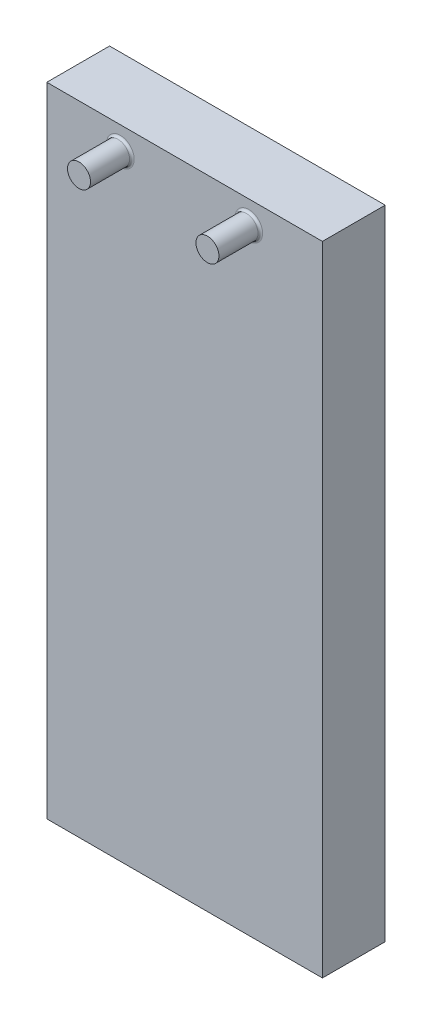
ISO-10303-21;
HEADER;
FILE_DESCRIPTION(('STEP AP214'),'2;1');
FILE_NAME('part.step','',(''),(''),'','','');
FILE_SCHEMA(('AUTOMOTIVE_DESIGN { 1 0 10303 214 1 1 1 1 }'));
ENDSEC;
DATA;
#1=APPLICATION_CONTEXT('core data for automotive mechanical design processes');
#2=APPLICATION_PROTOCOL_DEFINITION('international standard','automotive_design',2000,#1);
#3=PRODUCT_CONTEXT('',#1,'mechanical');
#4=PRODUCT('Part','Part','',(#3));
#5=PRODUCT_RELATED_PRODUCT_CATEGORY('part','',(#4));
#6=PRODUCT_DEFINITION_FORMATION('','',#4);
#7=PRODUCT_DEFINITION_CONTEXT('part definition',#1,'design');
#8=PRODUCT_DEFINITION('design','',#6,#7);
#9=PRODUCT_DEFINITION_SHAPE('','',#8);
#10=(LENGTH_UNIT() NAMED_UNIT(*) SI_UNIT(.MILLI.,.METRE.));
#11=(NAMED_UNIT(*) PLANE_ANGLE_UNIT() SI_UNIT($,.RADIAN.));
#12=(NAMED_UNIT(*) SI_UNIT($,.STERADIAN.) SOLID_ANGLE_UNIT());
#13=UNCERTAINTY_MEASURE_WITH_UNIT(LENGTH_MEASURE(1.E-05),#10,'distance_accuracy_value','');
#14=(GEOMETRIC_REPRESENTATION_CONTEXT(3) GLOBAL_UNCERTAINTY_ASSIGNED_CONTEXT((#13)) GLOBAL_UNIT_ASSIGNED_CONTEXT((#10,
#11,#12)) REPRESENTATION_CONTEXT('',''));
#15=CARTESIAN_POINT('',(0.,0.,0.));
#16=DIRECTION('',(0.,0.,1.));
#17=DIRECTION('',(1.,0.,0.));
#18=AXIS2_PLACEMENT_3D('',#15,#16,#17);
#19=CARTESIAN_POINT('',(59.92,277.37,13.65));
#20=DIRECTION('',(-1.,0.,0.));
#21=DIRECTION('',(0.,0.,1.));
#22=AXIS2_PLACEMENT_3D('',#19,#20,#21);
#23=PLANE('',#22);
#24=DIRECTION('',(0.,0.,-1.));
#25=VECTOR('',#24,1.);
#26=CARTESIAN_POINT('',(59.92,0.,13.65));
#27=LINE('',#26,#25);
#28=CARTESIAN_POINT('',(59.92,0.,13.65));
#29=VERTEX_POINT('',#28);
#30=CARTESIAN_POINT('',(59.92,0.,-13.65));
#31=VERTEX_POINT('',#30);
#32=EDGE_CURVE('E107',#29,#31,#27,.T.);
#33=ORIENTED_EDGE('',*,*,#32,.T.);
#34=DIRECTION('',(0.,-1.,0.));
#35=VECTOR('',#34,1.);
#36=CARTESIAN_POINT('',(59.92,277.37,-13.65));
#37=LINE('',#36,#35);
#38=CARTESIAN_POINT('',(59.92,277.37,-13.65));
#39=VERTEX_POINT('',#38);
#40=EDGE_CURVE('E98',#39,#31,#37,.T.);
#41=ORIENTED_EDGE('',*,*,#40,.F.);
#42=DIRECTION('',(0.,0.,-1.));
#43=VECTOR('',#42,1.);
#44=CARTESIAN_POINT('',(59.92,277.37,13.65));
#45=LINE('',#44,#43);
#46=CARTESIAN_POINT('',(59.92,277.37,13.65));
#47=VERTEX_POINT('',#46);
#48=EDGE_CURVE('E92',#47,#39,#45,.T.);
#49=ORIENTED_EDGE('',*,*,#48,.F.);
#50=DIRECTION('',(0.,-1.,0.));
#51=VECTOR('',#50,1.);
#52=CARTESIAN_POINT('',(59.92,277.37,13.65));
#53=LINE('',#52,#51);
#54=EDGE_CURVE('E103',#47,#29,#53,.T.);
#55=ORIENTED_EDGE('',*,*,#54,.T.);
#56=EDGE_LOOP('',(#33,#41,#49,#55));
#57=FACE_BOUND('',#56,.T.);
#58=ADVANCED_FACE('F39',(#57),#23,.F.);
#59=CARTESIAN_POINT('',(-59.92,277.37,-13.65));
#60=DIRECTION('',(0.,0.,1.));
#61=DIRECTION('',(1.,0.,0.));
#62=AXIS2_PLACEMENT_3D('',#59,#60,#61);
#63=PLANE('',#62);
#64=DIRECTION('',(-1.,0.,0.));
#65=VECTOR('',#64,1.);
#66=CARTESIAN_POINT('',(-59.92,0.,-13.65));
#67=LINE('',#66,#65);
#68=CARTESIAN_POINT('',(-59.92,0.,-13.65));
#69=VERTEX_POINT('',#68);
#70=EDGE_CURVE('E97',#31,#69,#67,.T.);
#71=ORIENTED_EDGE('',*,*,#70,.T.);
#72=DIRECTION('',(0.,-1.,0.));
#73=VECTOR('',#72,1.);
#74=CARTESIAN_POINT('',(-59.92,277.37,-13.65));
#75=LINE('',#74,#73);
#76=CARTESIAN_POINT('',(-59.92,277.37,-13.65));
#77=VERTEX_POINT('',#76);
#78=EDGE_CURVE('E95',#77,#69,#75,.T.);
#79=ORIENTED_EDGE('',*,*,#78,.F.);
#80=DIRECTION('',(-1.,0.,0.));
#81=VECTOR('',#80,1.);
#82=CARTESIAN_POINT('',(-59.92,277.37,-13.65));
#83=LINE('',#82,#81);
#84=EDGE_CURVE('E87',#39,#77,#83,.T.);
#85=ORIENTED_EDGE('',*,*,#84,.F.);
#86=ORIENTED_EDGE('',*,*,#40,.T.);
#87=EDGE_LOOP('',(#71,#79,#85,#86));
#88=FACE_BOUND('',#87,.T.);
#89=ADVANCED_FACE('F96',(#88),#63,.F.);
#90=CARTESIAN_POINT('',(-59.92,277.37,13.65));
#91=DIRECTION('',(1.,0.,0.));
#92=DIRECTION('',(0.,0.,-1.));
#93=AXIS2_PLACEMENT_3D('',#90,#91,#92);
#94=PLANE('',#93);
#95=DIRECTION('',(0.,0.,1.));
#96=VECTOR('',#95,1.);
#97=CARTESIAN_POINT('',(-59.92,0.,13.65));
#98=LINE('',#97,#96);
#99=CARTESIAN_POINT('',(-59.92,0.,13.65));
#100=VERTEX_POINT('',#99);
#101=EDGE_CURVE('E73',#69,#100,#98,.T.);
#102=ORIENTED_EDGE('',*,*,#101,.T.);
#103=DIRECTION('',(0.,-1.,0.));
#104=VECTOR('',#103,1.);
#105=CARTESIAN_POINT('',(-59.92,277.37,13.65));
#106=LINE('',#105,#104);
#107=CARTESIAN_POINT('',(-59.92,277.37,13.65));
#108=VERTEX_POINT('',#107);
#109=EDGE_CURVE('E99',#108,#100,#106,.T.);
#110=ORIENTED_EDGE('',*,*,#109,.F.);
#111=DIRECTION('',(0.,0.,1.));
#112=VECTOR('',#111,1.);
#113=CARTESIAN_POINT('',(-59.92,277.37,13.65));
#114=LINE('',#113,#112);
#115=EDGE_CURVE('E90',#77,#108,#114,.T.);
#116=ORIENTED_EDGE('',*,*,#115,.F.);
#117=ORIENTED_EDGE('',*,*,#78,.T.);
#118=EDGE_LOOP('',(#102,#110,#116,#117));
#119=FACE_BOUND('',#118,.T.);
#120=ADVANCED_FACE('F101',(#119),#94,.F.);
#121=CARTESIAN_POINT('',(-59.92,277.37,13.65));
#122=DIRECTION('',(0.,0.,-1.));
#123=DIRECTION('',(-1.,0.,0.));
#124=AXIS2_PLACEMENT_3D('',#121,#122,#123);
#125=PLANE('',#124);
#126=CARTESIAN_POINT('',(27.92,267.37,13.65));
#127=DIRECTION('',(0.,0.,-1.));
#128=DIRECTION('',(-1.,0.,0.));
#129=AXIS2_PLACEMENT_3D('',#126,#127,#128);
#130=CIRCLE('',#129,6.);
#131=CARTESIAN_POINT('',(21.92,267.37,13.65));
#132=VERTEX_POINT('',#131);
#133=EDGE_CURVE('E48',#132,#132,#130,.T.);
#134=ORIENTED_EDGE('',*,*,#133,.T.);
#135=EDGE_LOOP('',(#134));
#136=FACE_BOUND('',#135,.T.);
#137=CARTESIAN_POINT('',(-27.92,267.37,13.65));
#138=DIRECTION('',(0.,0.,-1.));
#139=DIRECTION('',(-1.,0.,0.));
#140=AXIS2_PLACEMENT_3D('',#137,#138,#139);
#141=CIRCLE('',#140,6.);
#142=CARTESIAN_POINT('',(-33.92,267.37,13.65));
#143=VERTEX_POINT('',#142);
#144=EDGE_CURVE('E120',#143,#143,#141,.T.);
#145=ORIENTED_EDGE('',*,*,#144,.T.);
#146=EDGE_LOOP('',(#145));
#147=FACE_BOUND('',#146,.T.);
#148=DIRECTION('',(1.,0.,0.));
#149=VECTOR('',#148,1.);
#150=CARTESIAN_POINT('',(-59.92,0.,13.65));
#151=LINE('',#150,#149);
#152=EDGE_CURVE('E79',#100,#29,#151,.T.);
#153=ORIENTED_EDGE('',*,*,#152,.T.);
#154=ORIENTED_EDGE('',*,*,#54,.F.);
#155=DIRECTION('',(1.,0.,0.));
#156=VECTOR('',#155,1.);
#157=CARTESIAN_POINT('',(-59.92,277.37,13.65));
#158=LINE('',#157,#156);
#159=EDGE_CURVE('E56',#108,#47,#158,.T.);
#160=ORIENTED_EDGE('',*,*,#159,.F.);
#161=ORIENTED_EDGE('',*,*,#109,.T.);
#162=EDGE_LOOP('',(#153,#154,#160,#161));
#163=FACE_BOUND('',#162,.T.);
#164=ADVANCED_FACE('F125',(#136,#147,#163),#125,.F.);
#165=CARTESIAN_POINT('',(0.,277.37,0.));
#166=DIRECTION('',(0.,-1.,0.));
#167=DIRECTION('',(0.,0.,-1.));
#168=AXIS2_PLACEMENT_3D('',#165,#166,#167);
#169=PLANE('',#168);
#170=ORIENTED_EDGE('',*,*,#48,.T.);
#171=ORIENTED_EDGE('',*,*,#84,.T.);
#172=ORIENTED_EDGE('',*,*,#115,.T.);
#173=ORIENTED_EDGE('',*,*,#159,.T.);
#174=EDGE_LOOP('',(#170,#171,#172,#173));
#175=FACE_BOUND('',#174,.T.);
#176=ADVANCED_FACE('F88',(#175),#169,.F.);
#177=CARTESIAN_POINT('',(0.,0.,0.));
#178=DIRECTION('',(0.,-1.,0.));
#179=DIRECTION('',(0.,0.,-1.));
#180=AXIS2_PLACEMENT_3D('',#177,#178,#179);
#181=PLANE('',#180);
#182=ORIENTED_EDGE('',*,*,#32,.F.);
#183=ORIENTED_EDGE('',*,*,#152,.F.);
#184=ORIENTED_EDGE('',*,*,#101,.F.);
#185=ORIENTED_EDGE('',*,*,#70,.F.);
#186=EDGE_LOOP('',(#182,#183,#184,#185));
#187=FACE_BOUND('',#186,.T.);
#188=ADVANCED_FACE('F138',(#187),#181,.T.);
#189=CARTESIAN_POINT('',(27.92,267.37,31.65));
#190=DIRECTION('',(0.,0.,-1.));
#191=DIRECTION('',(-1.,0.,0.));
#192=AXIS2_PLACEMENT_3D('',#189,#190,#191);
#193=CYLINDRICAL_SURFACE('',#192,5.);
#194=CARTESIAN_POINT('',(27.92,267.37,14.65));
#195=DIRECTION('',(0.,0.,-1.));
#196=DIRECTION('',(-1.,0.,0.));
#197=AXIS2_PLACEMENT_3D('',#194,#195,#196);
#198=CIRCLE('',#197,5.);
#199=CARTESIAN_POINT('',(22.92,267.37,14.65));
#200=VERTEX_POINT('',#199);
#201=EDGE_CURVE('E117',#200,#200,#198,.F.);
#202=ORIENTED_EDGE('',*,*,#201,.T.);
#203=EDGE_LOOP('',(#202));
#204=FACE_BOUND('',#203,.T.);
#205=CARTESIAN_POINT('',(27.92,267.37,31.65));
#206=DIRECTION('',(0.,0.,1.));
#207=DIRECTION('',(1.,0.,0.));
#208=AXIS2_PLACEMENT_3D('',#205,#206,#207);
#209=CIRCLE('',#208,5.);
#210=CARTESIAN_POINT('',(32.92,267.37,31.65));
#211=VERTEX_POINT('',#210);
#212=EDGE_CURVE('E110',#211,#211,#209,.T.);
#213=ORIENTED_EDGE('',*,*,#212,.F.);
#214=EDGE_LOOP('',(#213));
#215=FACE_BOUND('',#214,.T.);
#216=ADVANCED_FACE('F134',(#204,#215),#193,.T.);
#217=CARTESIAN_POINT('',(0.,0.,31.65));
#218=DIRECTION('',(0.,0.,1.));
#219=DIRECTION('',(1.,0.,0.));
#220=AXIS2_PLACEMENT_3D('',#217,#218,#219);
#221=PLANE('',#220);
#222=ORIENTED_EDGE('',*,*,#212,.T.);
#223=EDGE_LOOP('',(#222));
#224=FACE_BOUND('',#223,.T.);
#225=ADVANCED_FACE('F137',(#224),#221,.T.);
#226=CARTESIAN_POINT('',(-27.92,267.37,31.65));
#227=DIRECTION('',(0.,0.,-1.));
#228=DIRECTION('',(-1.,0.,0.));
#229=AXIS2_PLACEMENT_3D('',#226,#227,#228);
#230=CYLINDRICAL_SURFACE('',#229,5.);
#231=CARTESIAN_POINT('',(-27.92,267.37,14.65));
#232=DIRECTION('',(0.,0.,-1.));
#233=DIRECTION('',(-1.,0.,0.));
#234=AXIS2_PLACEMENT_3D('',#231,#232,#233);
#235=CIRCLE('',#234,5.);
#236=CARTESIAN_POINT('',(-32.92,267.37,14.65));
#237=VERTEX_POINT('',#236);
#238=EDGE_CURVE('E11',#237,#237,#235,.F.);
#239=ORIENTED_EDGE('',*,*,#238,.T.);
#240=EDGE_LOOP('',(#239));
#241=FACE_BOUND('',#240,.T.);
#242=CARTESIAN_POINT('',(-27.92,267.37,31.65));
#243=DIRECTION('',(0.,0.,1.));
#244=DIRECTION('',(1.,0.,0.));
#245=AXIS2_PLACEMENT_3D('',#242,#243,#244);
#246=CIRCLE('',#245,5.);
#247=CARTESIAN_POINT('',(-22.92,267.37,31.65));
#248=VERTEX_POINT('',#247);
#249=EDGE_CURVE('E143',#248,#248,#246,.T.);
#250=ORIENTED_EDGE('',*,*,#249,.F.);
#251=EDGE_LOOP('',(#250));
#252=FACE_BOUND('',#251,.T.);
#253=ADVANCED_FACE('F150',(#241,#252),#230,.T.);
#254=CARTESIAN_POINT('',(0.,0.,31.65));
#255=DIRECTION('',(0.,0.,1.));
#256=DIRECTION('',(1.,0.,0.));
#257=AXIS2_PLACEMENT_3D('',#254,#255,#256);
#258=PLANE('',#257);
#259=ORIENTED_EDGE('',*,*,#249,.T.);
#260=EDGE_LOOP('',(#259));
#261=FACE_BOUND('',#260,.T.);
#262=ADVANCED_FACE('F131',(#261),#258,.T.);
#263=CARTESIAN_POINT('',(27.92,267.37,14.65));
#264=DIRECTION('',(0.,0.,-1.));
#265=DIRECTION('',(-1.,0.,0.));
#266=AXIS2_PLACEMENT_3D('',#263,#264,#265);
#267=TOROIDAL_SURFACE('',#266,6.,1.);
#268=ORIENTED_EDGE('',*,*,#133,.F.);
#269=EDGE_LOOP('',(#268));
#270=FACE_BOUND('',#269,.T.);
#271=ORIENTED_EDGE('',*,*,#201,.F.);
#272=EDGE_LOOP('',(#271));
#273=FACE_BOUND('',#272,.T.);
#274=ADVANCED_FACE('F128',(#270,#273),#267,.F.);
#275=CARTESIAN_POINT('',(-27.92,267.37,14.65));
#276=DIRECTION('',(0.,0.,-1.));
#277=DIRECTION('',(-1.,0.,0.));
#278=AXIS2_PLACEMENT_3D('',#275,#276,#277);
#279=TOROIDAL_SURFACE('',#278,6.,1.);
#280=ORIENTED_EDGE('',*,*,#144,.F.);
#281=EDGE_LOOP('',(#280));
#282=FACE_BOUND('',#281,.T.);
#283=ORIENTED_EDGE('',*,*,#238,.F.);
#284=EDGE_LOOP('',(#283));
#285=FACE_BOUND('',#284,.T.);
#286=ADVANCED_FACE('F41',(#282,#285),#279,.F.);
#287=CLOSED_SHELL('',(#58,#89,#120,#164,#176,#188,#216,#225,#253,#262,#274,#286));
#288=MANIFOLD_SOLID_BREP('B2',#287);
#289=ADVANCED_BREP_SHAPE_REPRESENTATION('',(#18,#288),#14);
#290=SHAPE_DEFINITION_REPRESENTATION(#9,#289);
ENDSEC;
END-ISO-10303-21;
